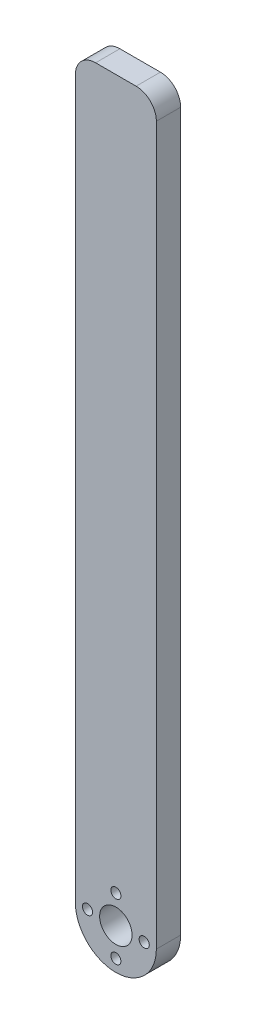
ISO-10303-21;
HEADER;
FILE_DESCRIPTION(('STEP AP214'),'2;1');
FILE_NAME('part.step','',(''),(''),'','','');
FILE_SCHEMA(('AUTOMOTIVE_DESIGN { 1 0 10303 214 1 1 1 1 }'));
ENDSEC;
DATA;
#1=APPLICATION_CONTEXT('core data for automotive mechanical design processes');
#2=APPLICATION_PROTOCOL_DEFINITION('international standard','automotive_design',2000,#1);
#3=PRODUCT_CONTEXT('',#1,'mechanical');
#4=PRODUCT('Part','Part','',(#3));
#5=PRODUCT_RELATED_PRODUCT_CATEGORY('part','',(#4));
#6=PRODUCT_DEFINITION_FORMATION('','',#4);
#7=PRODUCT_DEFINITION_CONTEXT('part definition',#1,'design');
#8=PRODUCT_DEFINITION('design','',#6,#7);
#9=PRODUCT_DEFINITION_SHAPE('','',#8);
#10=(LENGTH_UNIT() NAMED_UNIT(*) SI_UNIT(.MILLI.,.METRE.));
#11=(NAMED_UNIT(*) PLANE_ANGLE_UNIT() SI_UNIT($,.RADIAN.));
#12=(NAMED_UNIT(*) SI_UNIT($,.STERADIAN.) SOLID_ANGLE_UNIT());
#13=UNCERTAINTY_MEASURE_WITH_UNIT(LENGTH_MEASURE(1.E-05),#10,'distance_accuracy_value','');
#14=(GEOMETRIC_REPRESENTATION_CONTEXT(3) GLOBAL_UNCERTAINTY_ASSIGNED_CONTEXT((#13)) GLOBAL_UNIT_ASSIGNED_CONTEXT((#10,
#11,#12)) REPRESENTATION_CONTEXT('',''));
#15=CARTESIAN_POINT('',(0.,0.,0.));
#16=DIRECTION('',(0.,0.,1.));
#17=DIRECTION('',(1.,0.,0.));
#18=AXIS2_PLACEMENT_3D('',#15,#16,#17);
#19=CARTESIAN_POINT('',(0.,0.,6.));
#20=DIRECTION('',(1.,0.,0.));
#21=DIRECTION('',(0.,0.,-1.));
#22=AXIS2_PLACEMENT_3D('',#19,#20,#21);
#23=PLANE('',#22);
#24=DIRECTION('',(0.,-1.,0.));
#25=VECTOR('',#24,1.);
#26=CARTESIAN_POINT('',(0.,0.,6.));
#27=LINE('',#26,#25);
#28=CARTESIAN_POINT('',(0.,187.,6.));
#29=VERTEX_POINT('',#28);
#30=CARTESIAN_POINT('',(0.,10.,6.));
#31=VERTEX_POINT('',#30);
#32=EDGE_CURVE('E122',#29,#31,#27,.T.);
#33=ORIENTED_EDGE('',*,*,#32,.F.);
#34=DIRECTION('',(0.,0.,-1.));
#35=VECTOR('',#34,1.);
#36=CARTESIAN_POINT('',(0.,187.,6.));
#37=LINE('',#36,#35);
#38=CARTESIAN_POINT('',(0.,187.,0.));
#39=VERTEX_POINT('',#38);
#40=EDGE_CURVE('E11',#29,#39,#37,.T.);
#41=ORIENTED_EDGE('',*,*,#40,.T.);
#42=DIRECTION('',(0.,-1.,0.));
#43=VECTOR('',#42,1.);
#44=CARTESIAN_POINT('',(0.,0.,0.));
#45=LINE('',#44,#43);
#46=CARTESIAN_POINT('',(0.,10.,0.));
#47=VERTEX_POINT('',#46);
#48=EDGE_CURVE('E119',#39,#47,#45,.T.);
#49=ORIENTED_EDGE('',*,*,#48,.T.);
#50=DIRECTION('',(0.,0.,-1.));
#51=VECTOR('',#50,1.);
#52=CARTESIAN_POINT('',(0.,10.,6.));
#53=LINE('',#52,#51);
#54=EDGE_CURVE('E132',#47,#31,#53,.F.);
#55=ORIENTED_EDGE('',*,*,#54,.T.);
#56=EDGE_LOOP('',(#33,#41,#49,#55));
#57=FACE_BOUND('',#56,.T.);
#58=ADVANCED_FACE('F34',(#57),#23,.F.);
#59=CARTESIAN_POINT('',(20.,0.,6.));
#60=DIRECTION('',(-1.,0.,0.));
#61=DIRECTION('',(0.,0.,1.));
#62=AXIS2_PLACEMENT_3D('',#59,#60,#61);
#63=PLANE('',#62);
#64=DIRECTION('',(0.,1.,0.));
#65=VECTOR('',#64,1.);
#66=CARTESIAN_POINT('',(20.,0.,0.));
#67=LINE('',#66,#65);
#68=CARTESIAN_POINT('',(20.,10.,0.));
#69=VERTEX_POINT('',#68);
#70=CARTESIAN_POINT('',(20.,187.,0.));
#71=VERTEX_POINT('',#70);
#72=EDGE_CURVE('E111',#69,#71,#67,.T.);
#73=ORIENTED_EDGE('',*,*,#72,.T.);
#74=DIRECTION('',(0.,0.,-1.));
#75=VECTOR('',#74,1.);
#76=CARTESIAN_POINT('',(20.,187.,6.));
#77=LINE('',#76,#75);
#78=CARTESIAN_POINT('',(20.,187.,6.));
#79=VERTEX_POINT('',#78);
#80=EDGE_CURVE('E57',#71,#79,#77,.F.);
#81=ORIENTED_EDGE('',*,*,#80,.T.);
#82=DIRECTION('',(0.,1.,0.));
#83=VECTOR('',#82,1.);
#84=CARTESIAN_POINT('',(20.,0.,6.));
#85=LINE('',#84,#83);
#86=CARTESIAN_POINT('',(20.,10.,6.));
#87=VERTEX_POINT('',#86);
#88=EDGE_CURVE('E112',#87,#79,#85,.T.);
#89=ORIENTED_EDGE('',*,*,#88,.F.);
#90=DIRECTION('',(0.,0.,-1.));
#91=VECTOR('',#90,1.);
#92=CARTESIAN_POINT('',(20.,10.,6.));
#93=LINE('',#92,#91);
#94=EDGE_CURVE('E100',#87,#69,#93,.T.);
#95=ORIENTED_EDGE('',*,*,#94,.T.);
#96=EDGE_LOOP('',(#73,#81,#89,#95));
#97=FACE_BOUND('',#96,.T.);
#98=ADVANCED_FACE('F110',(#97),#63,.F.);
#99=CARTESIAN_POINT('',(0.,192.,6.));
#100=DIRECTION('',(0.,-1.,0.));
#101=DIRECTION('',(0.,0.,-1.));
#102=AXIS2_PLACEMENT_3D('',#99,#100,#101);
#103=PLANE('',#102);
#104=DIRECTION('',(-1.,0.,0.));
#105=VECTOR('',#104,1.);
#106=CARTESIAN_POINT('',(0.,192.,6.));
#107=LINE('',#106,#105);
#108=CARTESIAN_POINT('',(15.,192.,6.));
#109=VERTEX_POINT('',#108);
#110=CARTESIAN_POINT('',(5.,192.,6.));
#111=VERTEX_POINT('',#110);
#112=EDGE_CURVE('E113',#109,#111,#107,.T.);
#113=ORIENTED_EDGE('',*,*,#112,.F.);
#114=DIRECTION('',(0.,0.,-1.));
#115=VECTOR('',#114,1.);
#116=CARTESIAN_POINT('',(15.,192.,6.));
#117=LINE('',#116,#115);
#118=CARTESIAN_POINT('',(15.,192.,0.));
#119=VERTEX_POINT('',#118);
#120=EDGE_CURVE('E140',#109,#119,#117,.T.);
#121=ORIENTED_EDGE('',*,*,#120,.T.);
#122=DIRECTION('',(-1.,0.,0.));
#123=VECTOR('',#122,1.);
#124=CARTESIAN_POINT('',(0.,192.,0.));
#125=LINE('',#124,#123);
#126=CARTESIAN_POINT('',(5.,192.,0.));
#127=VERTEX_POINT('',#126);
#128=EDGE_CURVE('E118',#119,#127,#125,.T.);
#129=ORIENTED_EDGE('',*,*,#128,.T.);
#130=DIRECTION('',(0.,0.,-1.));
#131=VECTOR('',#130,1.);
#132=CARTESIAN_POINT('',(5.,192.,6.));
#133=LINE('',#132,#131);
#134=EDGE_CURVE('E135',#127,#111,#133,.F.);
#135=ORIENTED_EDGE('',*,*,#134,.T.);
#136=EDGE_LOOP('',(#113,#121,#129,#135));
#137=FACE_BOUND('',#136,.T.);
#138=ADVANCED_FACE('F153',(#137),#103,.F.);
#139=CARTESIAN_POINT('',(0.,0.,6.));
#140=DIRECTION('',(0.,0.,-1.));
#141=DIRECTION('',(-1.,0.,0.));
#142=AXIS2_PLACEMENT_3D('',#139,#140,#141);
#143=PLANE('',#142);
#144=CARTESIAN_POINT('',(17.,10.,6.));
#145=DIRECTION('',(0.,0.,-1.));
#146=DIRECTION('',(-1.,0.,0.));
#147=AXIS2_PLACEMENT_3D('',#144,#145,#146);
#148=CIRCLE('',#147,1.25);
#149=CARTESIAN_POINT('',(15.75,10.,6.));
#150=VERTEX_POINT('',#149);
#151=EDGE_CURVE('E198',#150,#150,#148,.T.);
#152=ORIENTED_EDGE('',*,*,#151,.T.);
#153=EDGE_LOOP('',(#152));
#154=FACE_BOUND('',#153,.T.);
#155=CARTESIAN_POINT('',(10.,3.,6.));
#156=DIRECTION('',(0.,0.,-1.));
#157=DIRECTION('',(-1.,0.,0.));
#158=AXIS2_PLACEMENT_3D('',#155,#156,#157);
#159=CIRCLE('',#158,1.25);
#160=CARTESIAN_POINT('',(8.75,3.,6.));
#161=VERTEX_POINT('',#160);
#162=EDGE_CURVE('E201',#161,#161,#159,.T.);
#163=ORIENTED_EDGE('',*,*,#162,.T.);
#164=EDGE_LOOP('',(#163));
#165=FACE_BOUND('',#164,.T.);
#166=CARTESIAN_POINT('',(3.,10.,6.));
#167=DIRECTION('',(0.,0.,-1.));
#168=DIRECTION('',(-1.,0.,0.));
#169=AXIS2_PLACEMENT_3D('',#166,#167,#168);
#170=CIRCLE('',#169,1.25);
#171=CARTESIAN_POINT('',(1.75,10.,6.));
#172=VERTEX_POINT('',#171);
#173=EDGE_CURVE('E204',#172,#172,#170,.T.);
#174=ORIENTED_EDGE('',*,*,#173,.T.);
#175=EDGE_LOOP('',(#174));
#176=FACE_BOUND('',#175,.T.);
#177=CARTESIAN_POINT('',(10.,17.,6.));
#178=DIRECTION('',(0.,0.,-1.));
#179=DIRECTION('',(-1.,0.,0.));
#180=AXIS2_PLACEMENT_3D('',#177,#178,#179);
#181=CIRCLE('',#180,1.25);
#182=CARTESIAN_POINT('',(8.75,17.,6.));
#183=VERTEX_POINT('',#182);
#184=EDGE_CURVE('E138',#183,#183,#181,.T.);
#185=ORIENTED_EDGE('',*,*,#184,.T.);
#186=EDGE_LOOP('',(#185));
#187=FACE_BOUND('',#186,.T.);
#188=CARTESIAN_POINT('',(10.,10.,6.));
#189=DIRECTION('',(0.,0.,-1.));
#190=DIRECTION('',(-1.,0.,0.));
#191=AXIS2_PLACEMENT_3D('',#188,#189,#190);
#192=CIRCLE('',#191,4.);
#193=CARTESIAN_POINT('',(6.,10.,6.));
#194=VERTEX_POINT('',#193);
#195=EDGE_CURVE('E124',#194,#194,#192,.T.);
#196=ORIENTED_EDGE('',*,*,#195,.T.);
#197=EDGE_LOOP('',(#196));
#198=FACE_BOUND('',#197,.T.);
#199=ORIENTED_EDGE('',*,*,#88,.T.);
#200=CARTESIAN_POINT('',(15.,187.,6.));
#201=DIRECTION('',(0.,0.,-1.));
#202=DIRECTION('',(-1.,0.,0.));
#203=AXIS2_PLACEMENT_3D('',#200,#201,#202);
#204=CIRCLE('',#203,5.);
#205=EDGE_CURVE('E42',#79,#109,#204,.F.);
#206=ORIENTED_EDGE('',*,*,#205,.T.);
#207=ORIENTED_EDGE('',*,*,#112,.T.);
#208=CARTESIAN_POINT('',(5.,187.,6.));
#209=DIRECTION('',(0.,0.,-1.));
#210=DIRECTION('',(-1.,0.,0.));
#211=AXIS2_PLACEMENT_3D('',#208,#209,#210);
#212=CIRCLE('',#211,5.);
#213=EDGE_CURVE('E49',#111,#29,#212,.F.);
#214=ORIENTED_EDGE('',*,*,#213,.T.);
#215=ORIENTED_EDGE('',*,*,#32,.T.);
#216=CARTESIAN_POINT('',(10.,10.,6.));
#217=DIRECTION('',(0.,0.,-1.));
#218=DIRECTION('',(-1.,0.,0.));
#219=AXIS2_PLACEMENT_3D('',#216,#217,#218);
#220=CIRCLE('',#219,10.);
#221=CARTESIAN_POINT('',(10.,0.,6.));
#222=VERTEX_POINT('',#221);
#223=EDGE_CURVE('E107',#31,#222,#220,.F.);
#224=ORIENTED_EDGE('',*,*,#223,.T.);
#225=CARTESIAN_POINT('',(10.,10.,6.));
#226=DIRECTION('',(0.,0.,-1.));
#227=DIRECTION('',(-1.,0.,0.));
#228=AXIS2_PLACEMENT_3D('',#225,#226,#227);
#229=CIRCLE('',#228,10.);
#230=EDGE_CURVE('E130',#222,#87,#229,.F.);
#231=ORIENTED_EDGE('',*,*,#230,.T.);
#232=EDGE_LOOP('',(#199,#206,#207,#214,#215,#224,#231));
#233=FACE_BOUND('',#232,.T.);
#234=ADVANCED_FACE('F149',(#154,#165,#176,#187,#198,#233),#143,.F.);
#235=CARTESIAN_POINT('',(0.,0.,0.));
#236=DIRECTION('',(0.,0.,-1.));
#237=DIRECTION('',(-1.,0.,0.));
#238=AXIS2_PLACEMENT_3D('',#235,#236,#237);
#239=PLANE('',#238);
#240=CARTESIAN_POINT('',(17.,10.,0.));
#241=DIRECTION('',(0.,0.,1.));
#242=DIRECTION('',(1.,0.,0.));
#243=AXIS2_PLACEMENT_3D('',#240,#241,#242);
#244=CIRCLE('',#243,1.25);
#245=CARTESIAN_POINT('',(18.25,10.,0.));
#246=VERTEX_POINT('',#245);
#247=EDGE_CURVE('E207',#246,#246,#244,.T.);
#248=ORIENTED_EDGE('',*,*,#247,.T.);
#249=EDGE_LOOP('',(#248));
#250=FACE_BOUND('',#249,.T.);
#251=CARTESIAN_POINT('',(10.,3.,0.));
#252=DIRECTION('',(0.,0.,1.));
#253=DIRECTION('',(1.,0.,0.));
#254=AXIS2_PLACEMENT_3D('',#251,#252,#253);
#255=CIRCLE('',#254,1.25);
#256=CARTESIAN_POINT('',(11.25,3.,0.));
#257=VERTEX_POINT('',#256);
#258=EDGE_CURVE('E211',#257,#257,#255,.T.);
#259=ORIENTED_EDGE('',*,*,#258,.T.);
#260=EDGE_LOOP('',(#259));
#261=FACE_BOUND('',#260,.T.);
#262=CARTESIAN_POINT('',(3.,10.,0.));
#263=DIRECTION('',(0.,0.,1.));
#264=DIRECTION('',(1.,0.,0.));
#265=AXIS2_PLACEMENT_3D('',#262,#263,#264);
#266=CIRCLE('',#265,1.25);
#267=CARTESIAN_POINT('',(4.25,10.,0.));
#268=VERTEX_POINT('',#267);
#269=EDGE_CURVE('E208',#268,#268,#266,.T.);
#270=ORIENTED_EDGE('',*,*,#269,.T.);
#271=EDGE_LOOP('',(#270));
#272=FACE_BOUND('',#271,.T.);
#273=CARTESIAN_POINT('',(10.,17.,0.));
#274=DIRECTION('',(0.,0.,1.));
#275=DIRECTION('',(1.,0.,0.));
#276=AXIS2_PLACEMENT_3D('',#273,#274,#275);
#277=CIRCLE('',#276,1.25);
#278=CARTESIAN_POINT('',(11.25,17.,0.));
#279=VERTEX_POINT('',#278);
#280=EDGE_CURVE('E195',#279,#279,#277,.T.);
#281=ORIENTED_EDGE('',*,*,#280,.T.);
#282=EDGE_LOOP('',(#281));
#283=FACE_BOUND('',#282,.T.);
#284=CARTESIAN_POINT('',(10.,10.,0.));
#285=DIRECTION('',(0.,0.,1.));
#286=DIRECTION('',(1.,0.,0.));
#287=AXIS2_PLACEMENT_3D('',#284,#285,#286);
#288=CIRCLE('',#287,4.);
#289=CARTESIAN_POINT('',(14.,10.,0.));
#290=VERTEX_POINT('',#289);
#291=EDGE_CURVE('E137',#290,#290,#288,.T.);
#292=ORIENTED_EDGE('',*,*,#291,.T.);
#293=EDGE_LOOP('',(#292));
#294=FACE_BOUND('',#293,.T.);
#295=ORIENTED_EDGE('',*,*,#128,.F.);
#296=CARTESIAN_POINT('',(15.,187.,0.));
#297=DIRECTION('',(0.,0.,-1.));
#298=DIRECTION('',(-1.,0.,0.));
#299=AXIS2_PLACEMENT_3D('',#296,#297,#298);
#300=CIRCLE('',#299,5.);
#301=EDGE_CURVE('E117',#119,#71,#300,.T.);
#302=ORIENTED_EDGE('',*,*,#301,.T.);
#303=ORIENTED_EDGE('',*,*,#72,.F.);
#304=CARTESIAN_POINT('',(10.,10.,0.));
#305=DIRECTION('',(0.,0.,-1.));
#306=DIRECTION('',(-1.,0.,0.));
#307=AXIS2_PLACEMENT_3D('',#304,#305,#306);
#308=CIRCLE('',#307,10.);
#309=CARTESIAN_POINT('',(10.,0.,0.));
#310=VERTEX_POINT('',#309);
#311=EDGE_CURVE('E96',#69,#310,#308,.T.);
#312=ORIENTED_EDGE('',*,*,#311,.T.);
#313=CARTESIAN_POINT('',(10.,10.,0.));
#314=DIRECTION('',(0.,0.,-1.));
#315=DIRECTION('',(-1.,0.,0.));
#316=AXIS2_PLACEMENT_3D('',#313,#314,#315);
#317=CIRCLE('',#316,10.);
#318=EDGE_CURVE('E108',#310,#47,#317,.T.);
#319=ORIENTED_EDGE('',*,*,#318,.T.);
#320=ORIENTED_EDGE('',*,*,#48,.F.);
#321=CARTESIAN_POINT('',(5.,187.,0.));
#322=DIRECTION('',(0.,0.,-1.));
#323=DIRECTION('',(-1.,0.,0.));
#324=AXIS2_PLACEMENT_3D('',#321,#322,#323);
#325=CIRCLE('',#324,5.);
#326=EDGE_CURVE('E143',#39,#127,#325,.T.);
#327=ORIENTED_EDGE('',*,*,#326,.T.);
#328=EDGE_LOOP('',(#295,#302,#303,#312,#319,#320,#327));
#329=FACE_BOUND('',#328,.T.);
#330=ADVANCED_FACE('F116',(#250,#261,#272,#283,#294,#329),#239,.T.);
#331=CARTESIAN_POINT('',(10.,10.,0.));
#332=DIRECTION('',(0.,0.,1.));
#333=DIRECTION('',(1.,0.,0.));
#334=AXIS2_PLACEMENT_3D('',#331,#332,#333);
#335=CYLINDRICAL_SURFACE('',#334,4.);
#336=ORIENTED_EDGE('',*,*,#291,.F.);
#337=EDGE_LOOP('',(#336));
#338=FACE_BOUND('',#337,.T.);
#339=ORIENTED_EDGE('',*,*,#195,.F.);
#340=EDGE_LOOP('',(#339));
#341=FACE_BOUND('',#340,.T.);
#342=ADVANCED_FACE('F175',(#338,#341),#335,.F.);
#343=CARTESIAN_POINT('',(10.,10.,6.));
#344=DIRECTION('',(0.,0.,-1.));
#345=DIRECTION('',(-1.,0.,0.));
#346=AXIS2_PLACEMENT_3D('',#343,#344,#345);
#347=CYLINDRICAL_SURFACE('',#346,10.);
#348=DIRECTION('',(0.,0.,-1.));
#349=VECTOR('',#348,1.);
#350=CARTESIAN_POINT('',(10.,0.,6.));
#351=LINE('',#350,#349);
#352=EDGE_CURVE('E102',#222,#310,#351,.T.);
#353=ORIENTED_EDGE('',*,*,#352,.F.);
#354=ORIENTED_EDGE('',*,*,#223,.F.);
#355=ORIENTED_EDGE('',*,*,#54,.F.);
#356=ORIENTED_EDGE('',*,*,#318,.F.);
#357=EDGE_LOOP('',(#353,#354,#355,#356));
#358=FACE_BOUND('',#357,.T.);
#359=ADVANCED_FACE('F163',(#358),#347,.T.);
#360=CARTESIAN_POINT('',(10.,10.,6.));
#361=DIRECTION('',(0.,0.,-1.));
#362=DIRECTION('',(-1.,0.,0.));
#363=AXIS2_PLACEMENT_3D('',#360,#361,#362);
#364=CYLINDRICAL_SURFACE('',#363,10.);
#365=ORIENTED_EDGE('',*,*,#230,.F.);
#366=ORIENTED_EDGE('',*,*,#352,.T.);
#367=ORIENTED_EDGE('',*,*,#311,.F.);
#368=ORIENTED_EDGE('',*,*,#94,.F.);
#369=EDGE_LOOP('',(#365,#366,#367,#368));
#370=FACE_BOUND('',#369,.T.);
#371=ADVANCED_FACE('F99',(#370),#364,.T.);
#372=CARTESIAN_POINT('',(15.,187.,6.));
#373=DIRECTION('',(0.,0.,-1.));
#374=DIRECTION('',(-1.,0.,0.));
#375=AXIS2_PLACEMENT_3D('',#372,#373,#374);
#376=CYLINDRICAL_SURFACE('',#375,5.);
#377=ORIENTED_EDGE('',*,*,#205,.F.);
#378=ORIENTED_EDGE('',*,*,#80,.F.);
#379=ORIENTED_EDGE('',*,*,#301,.F.);
#380=ORIENTED_EDGE('',*,*,#120,.F.);
#381=EDGE_LOOP('',(#377,#378,#379,#380));
#382=FACE_BOUND('',#381,.T.);
#383=ADVANCED_FACE('F155',(#382),#376,.T.);
#384=CARTESIAN_POINT('',(5.,187.,6.));
#385=DIRECTION('',(0.,0.,-1.));
#386=DIRECTION('',(-1.,0.,0.));
#387=AXIS2_PLACEMENT_3D('',#384,#385,#386);
#388=CYLINDRICAL_SURFACE('',#387,5.);
#389=ORIENTED_EDGE('',*,*,#213,.F.);
#390=ORIENTED_EDGE('',*,*,#134,.F.);
#391=ORIENTED_EDGE('',*,*,#326,.F.);
#392=ORIENTED_EDGE('',*,*,#40,.F.);
#393=EDGE_LOOP('',(#389,#390,#391,#392));
#394=FACE_BOUND('',#393,.T.);
#395=ADVANCED_FACE('F36',(#394),#388,.T.);
#396=CARTESIAN_POINT('',(10.,17.,0.));
#397=DIRECTION('',(0.,0.,1.));
#398=DIRECTION('',(1.,0.,0.));
#399=AXIS2_PLACEMENT_3D('',#396,#397,#398);
#400=CYLINDRICAL_SURFACE('',#399,1.25);
#401=ORIENTED_EDGE('',*,*,#280,.F.);
#402=EDGE_LOOP('',(#401));
#403=FACE_BOUND('',#402,.T.);
#404=ORIENTED_EDGE('',*,*,#184,.F.);
#405=EDGE_LOOP('',(#404));
#406=FACE_BOUND('',#405,.T.);
#407=ADVANCED_FACE('F161',(#403,#406),#400,.F.);
#408=CARTESIAN_POINT('',(3.,10.,0.));
#409=DIRECTION('',(0.,0.,1.));
#410=DIRECTION('',(1.,0.,0.));
#411=AXIS2_PLACEMENT_3D('',#408,#409,#410);
#412=CYLINDRICAL_SURFACE('',#411,1.25);
#413=ORIENTED_EDGE('',*,*,#269,.F.);
#414=EDGE_LOOP('',(#413));
#415=FACE_BOUND('',#414,.T.);
#416=ORIENTED_EDGE('',*,*,#173,.F.);
#417=EDGE_LOOP('',(#416));
#418=FACE_BOUND('',#417,.T.);
#419=ADVANCED_FACE('F239',(#415,#418),#412,.F.);
#420=CARTESIAN_POINT('',(10.,3.,0.));
#421=DIRECTION('',(0.,0.,1.));
#422=DIRECTION('',(1.,0.,0.));
#423=AXIS2_PLACEMENT_3D('',#420,#421,#422);
#424=CYLINDRICAL_SURFACE('',#423,1.25);
#425=ORIENTED_EDGE('',*,*,#258,.F.);
#426=EDGE_LOOP('',(#425));
#427=FACE_BOUND('',#426,.T.);
#428=ORIENTED_EDGE('',*,*,#162,.F.);
#429=EDGE_LOOP('',(#428));
#430=FACE_BOUND('',#429,.T.);
#431=ADVANCED_FACE('F222',(#427,#430),#424,.F.);
#432=CARTESIAN_POINT('',(17.,10.,0.));
#433=DIRECTION('',(0.,0.,1.));
#434=DIRECTION('',(1.,0.,0.));
#435=AXIS2_PLACEMENT_3D('',#432,#433,#434);
#436=CYLINDRICAL_SURFACE('',#435,1.25);
#437=ORIENTED_EDGE('',*,*,#247,.F.);
#438=EDGE_LOOP('',(#437));
#439=FACE_BOUND('',#438,.T.);
#440=ORIENTED_EDGE('',*,*,#151,.F.);
#441=EDGE_LOOP('',(#440));
#442=FACE_BOUND('',#441,.T.);
#443=ADVANCED_FACE('F219',(#439,#442),#436,.F.);
#444=CLOSED_SHELL('',(#58,#98,#138,#234,#330,#342,#359,#371,#383,#395,#407,#419,#431,#443));
#445=MANIFOLD_SOLID_BREP('B2',#444);
#446=ADVANCED_BREP_SHAPE_REPRESENTATION('',(#18,#445),#14);
#447=SHAPE_DEFINITION_REPRESENTATION(#9,#446);
ENDSEC;
END-ISO-10303-21;
